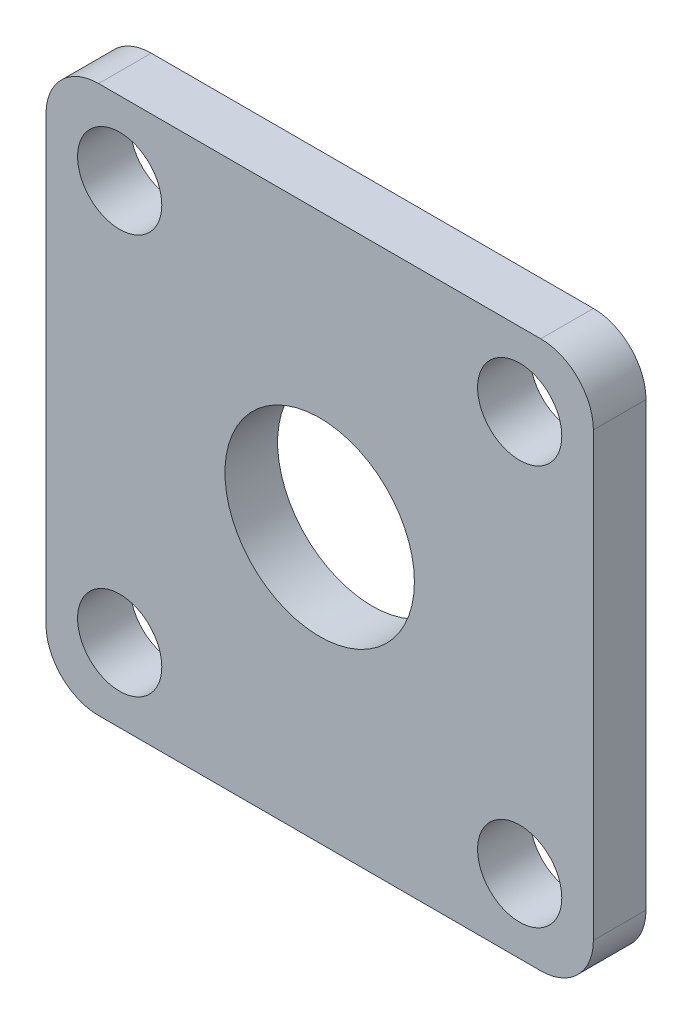
ISO-10303-21;
HEADER;
FILE_DESCRIPTION(('STEP AP214'),'2;1');
FILE_NAME('part.step','',(''),(''),'','','');
FILE_SCHEMA(('AUTOMOTIVE_DESIGN { 1 0 10303 214 1 1 1 1 }'));
ENDSEC;
DATA;
#1=APPLICATION_CONTEXT('core data for automotive mechanical design processes');
#2=APPLICATION_PROTOCOL_DEFINITION('international standard','automotive_design',2000,#1);
#3=PRODUCT_CONTEXT('',#1,'mechanical');
#4=PRODUCT('Part','Part','',(#3));
#5=PRODUCT_RELATED_PRODUCT_CATEGORY('part','',(#4));
#6=PRODUCT_DEFINITION_FORMATION('','',#4);
#7=PRODUCT_DEFINITION_CONTEXT('part definition',#1,'design');
#8=PRODUCT_DEFINITION('design','',#6,#7);
#9=PRODUCT_DEFINITION_SHAPE('','',#8);
#10=(LENGTH_UNIT() NAMED_UNIT(*) SI_UNIT(.MILLI.,.METRE.));
#11=(NAMED_UNIT(*) PLANE_ANGLE_UNIT() SI_UNIT($,.RADIAN.));
#12=(NAMED_UNIT(*) SI_UNIT($,.STERADIAN.) SOLID_ANGLE_UNIT());
#13=UNCERTAINTY_MEASURE_WITH_UNIT(LENGTH_MEASURE(1.E-05),#10,'distance_accuracy_value','');
#14=(GEOMETRIC_REPRESENTATION_CONTEXT(3) GLOBAL_UNCERTAINTY_ASSIGNED_CONTEXT((#13)) GLOBAL_UNIT_ASSIGNED_CONTEXT((#10,
#11,#12)) REPRESENTATION_CONTEXT('',''));
#15=CARTESIAN_POINT('',(0.,0.,0.));
#16=DIRECTION('',(0.,0.,1.));
#17=DIRECTION('',(1.,0.,0.));
#18=AXIS2_PLACEMENT_3D('',#15,#16,#17);
#19=CARTESIAN_POINT('',(5.,5.,5.));
#20=DIRECTION('',(0.,0.,1.));
#21=DIRECTION('',(1.,0.,0.));
#22=AXIS2_PLACEMENT_3D('',#19,#20,#21);
#23=PLANE('',#22);
#24=CARTESIAN_POINT('',(45.,7.00000000000002,5.));
#25=DIRECTION('',(0.,0.,1.));
#26=DIRECTION('',(1.,0.,0.));
#27=AXIS2_PLACEMENT_3D('',#24,#25,#26);
#28=CIRCLE('',#27,4.);
#29=CARTESIAN_POINT('',(49.,7.00000000000002,5.));
#30=VERTEX_POINT('',#29);
#31=EDGE_CURVE('E191',#30,#30,#28,.T.);
#32=ORIENTED_EDGE('',*,*,#31,.F.);
#33=EDGE_LOOP('',(#32));
#34=FACE_BOUND('',#33,.T.);
#35=CARTESIAN_POINT('',(45.,45.,5.));
#36=DIRECTION('',(0.,0.,1.));
#37=DIRECTION('',(1.,0.,0.));
#38=AXIS2_PLACEMENT_3D('',#35,#36,#37);
#39=CIRCLE('',#38,4.00000000000001);
#40=CARTESIAN_POINT('',(49.,45.,5.));
#41=VERTEX_POINT('',#40);
#42=EDGE_CURVE('E179',#41,#41,#39,.T.);
#43=ORIENTED_EDGE('',*,*,#42,.F.);
#44=EDGE_LOOP('',(#43));
#45=FACE_BOUND('',#44,.T.);
#46=CARTESIAN_POINT('',(5.,5.,5.));
#47=DIRECTION('',(0.,0.,1.));
#48=DIRECTION('',(1.,0.,0.));
#49=AXIS2_PLACEMENT_3D('',#46,#47,#48);
#50=CIRCLE('',#49,5.);
#51=CARTESIAN_POINT('',(0.,5.00000000000003,5.));
#52=VERTEX_POINT('',#51);
#53=CARTESIAN_POINT('',(5.00000000000004,0.,5.));
#54=VERTEX_POINT('',#53);
#55=EDGE_CURVE('E142',#52,#54,#50,.T.);
#56=ORIENTED_EDGE('',*,*,#55,.T.);
#57=DIRECTION('',(1.,0.,0.));
#58=VECTOR('',#57,1.);
#59=CARTESIAN_POINT('',(5.00000000000004,0.,5.));
#60=LINE('',#59,#58);
#61=CARTESIAN_POINT('',(46.9999999999999,0.,5.));
#62=VERTEX_POINT('',#61);
#63=EDGE_CURVE('E90',#54,#62,#60,.T.);
#64=ORIENTED_EDGE('',*,*,#63,.T.);
#65=CARTESIAN_POINT('',(47.,5.00000000000001,5.));
#66=DIRECTION('',(0.,0.,1.));
#67=DIRECTION('',(1.,0.,0.));
#68=AXIS2_PLACEMENT_3D('',#65,#66,#67);
#69=CIRCLE('',#68,5.);
#70=CARTESIAN_POINT('',(52.,5.00000000000005,5.));
#71=VERTEX_POINT('',#70);
#72=EDGE_CURVE('E157',#62,#71,#69,.T.);
#73=ORIENTED_EDGE('',*,*,#72,.T.);
#74=DIRECTION('',(0.,1.,0.));
#75=VECTOR('',#74,1.);
#76=CARTESIAN_POINT('',(52.,47.,5.));
#77=LINE('',#76,#75);
#78=CARTESIAN_POINT('',(52.,47.,5.));
#79=VERTEX_POINT('',#78);
#80=EDGE_CURVE('E170',#71,#79,#77,.T.);
#81=ORIENTED_EDGE('',*,*,#80,.T.);
#82=CARTESIAN_POINT('',(47.,47.,5.));
#83=DIRECTION('',(0.,0.,1.));
#84=DIRECTION('',(-1.,0.,0.));
#85=AXIS2_PLACEMENT_3D('',#82,#83,#84);
#86=CIRCLE('',#85,5.);
#87=CARTESIAN_POINT('',(46.9999999999999,52.,5.));
#88=VERTEX_POINT('',#87);
#89=EDGE_CURVE('E109',#79,#88,#86,.T.);
#90=ORIENTED_EDGE('',*,*,#89,.T.);
#91=DIRECTION('',(-1.,0.,0.));
#92=VECTOR('',#91,1.);
#93=CARTESIAN_POINT('',(5.00000000000001,52.,5.));
#94=LINE('',#93,#92);
#95=CARTESIAN_POINT('',(5.00000000000001,52.,5.));
#96=VERTEX_POINT('',#95);
#97=EDGE_CURVE('E103',#88,#96,#94,.T.);
#98=ORIENTED_EDGE('',*,*,#97,.T.);
#99=CARTESIAN_POINT('',(4.99999999999998,47.,5.));
#100=DIRECTION('',(0.,0.,1.));
#101=DIRECTION('',(1.,0.,0.));
#102=AXIS2_PLACEMENT_3D('',#99,#100,#101);
#103=CIRCLE('',#102,5.);
#104=CARTESIAN_POINT('',(0.,47.,5.));
#105=VERTEX_POINT('',#104);
#106=EDGE_CURVE('E107',#96,#105,#103,.T.);
#107=ORIENTED_EDGE('',*,*,#106,.T.);
#108=DIRECTION('',(0.,-1.,0.));
#109=VECTOR('',#108,1.);
#110=CARTESIAN_POINT('',(0.,47.,5.));
#111=LINE('',#110,#109);
#112=EDGE_CURVE('E47',#105,#52,#111,.T.);
#113=ORIENTED_EDGE('',*,*,#112,.T.);
#114=EDGE_LOOP('',(#56,#64,#73,#81,#90,#98,#107,#113));
#115=FACE_BOUND('',#114,.T.);
#116=CARTESIAN_POINT('',(6.99999999999997,45.,5.));
#117=DIRECTION('',(0.,0.,1.));
#118=DIRECTION('',(1.,0.,0.));
#119=AXIS2_PLACEMENT_3D('',#116,#117,#118);
#120=CIRCLE('',#119,4.);
#121=CARTESIAN_POINT('',(11.,45.,5.));
#122=VERTEX_POINT('',#121);
#123=EDGE_CURVE('E131',#122,#122,#120,.T.);
#124=ORIENTED_EDGE('',*,*,#123,.F.);
#125=EDGE_LOOP('',(#124));
#126=FACE_BOUND('',#125,.T.);
#127=CARTESIAN_POINT('',(7.00000000000001,6.99999999999998,5.));
#128=DIRECTION('',(0.,0.,1.));
#129=DIRECTION('',(1.,0.,0.));
#130=AXIS2_PLACEMENT_3D('',#127,#128,#129);
#131=CIRCLE('',#130,4.);
#132=CARTESIAN_POINT('',(11.,6.99999999999998,5.));
#133=VERTEX_POINT('',#132);
#134=EDGE_CURVE('E185',#133,#133,#131,.T.);
#135=ORIENTED_EDGE('',*,*,#134,.F.);
#136=EDGE_LOOP('',(#135));
#137=FACE_BOUND('',#136,.T.);
#138=CARTESIAN_POINT('',(26.,26.,5.));
#139=DIRECTION('',(0.,0.,1.));
#140=DIRECTION('',(1.,0.,0.));
#141=AXIS2_PLACEMENT_3D('',#138,#139,#140);
#142=CIRCLE('',#141,9.);
#143=CARTESIAN_POINT('',(35.,26.,5.));
#144=VERTEX_POINT('',#143);
#145=EDGE_CURVE('E197',#144,#144,#142,.T.);
#146=ORIENTED_EDGE('',*,*,#145,.F.);
#147=EDGE_LOOP('',(#146));
#148=FACE_BOUND('',#147,.T.);
#149=ADVANCED_FACE('F30',(#34,#45,#115,#126,#137,#148),#23,.T.);
#150=CARTESIAN_POINT('',(5.,5.,0.));
#151=DIRECTION('',(0.,0.,1.));
#152=DIRECTION('',(1.,0.,0.));
#153=AXIS2_PLACEMENT_3D('',#150,#151,#152);
#154=PLANE('',#153);
#155=CARTESIAN_POINT('',(45.,7.00000000000002,0.));
#156=DIRECTION('',(0.,0.,1.));
#157=DIRECTION('',(1.,0.,0.));
#158=AXIS2_PLACEMENT_3D('',#155,#156,#157);
#159=CIRCLE('',#158,4.);
#160=CARTESIAN_POINT('',(49.,7.00000000000002,0.));
#161=VERTEX_POINT('',#160);
#162=EDGE_CURVE('E194',#161,#161,#159,.T.);
#163=ORIENTED_EDGE('',*,*,#162,.T.);
#164=EDGE_LOOP('',(#163));
#165=FACE_BOUND('',#164,.T.);
#166=CARTESIAN_POINT('',(45.,45.,0.));
#167=DIRECTION('',(0.,0.,1.));
#168=DIRECTION('',(1.,0.,0.));
#169=AXIS2_PLACEMENT_3D('',#166,#167,#168);
#170=CIRCLE('',#169,4.00000000000001);
#171=CARTESIAN_POINT('',(49.,45.,0.));
#172=VERTEX_POINT('',#171);
#173=EDGE_CURVE('E182',#172,#172,#170,.T.);
#174=ORIENTED_EDGE('',*,*,#173,.T.);
#175=EDGE_LOOP('',(#174));
#176=FACE_BOUND('',#175,.T.);
#177=CARTESIAN_POINT('',(5.,5.,0.));
#178=DIRECTION('',(0.,0.,1.));
#179=DIRECTION('',(1.,0.,0.));
#180=AXIS2_PLACEMENT_3D('',#177,#178,#179);
#181=CIRCLE('',#180,5.);
#182=CARTESIAN_POINT('',(0.,5.00000000000003,0.));
#183=VERTEX_POINT('',#182);
#184=CARTESIAN_POINT('',(5.00000000000004,0.,0.));
#185=VERTEX_POINT('',#184);
#186=EDGE_CURVE('E127',#183,#185,#181,.T.);
#187=ORIENTED_EDGE('',*,*,#186,.F.);
#188=DIRECTION('',(0.,-1.,0.));
#189=VECTOR('',#188,1.);
#190=CARTESIAN_POINT('',(0.,47.,0.));
#191=LINE('',#190,#189);
#192=CARTESIAN_POINT('',(0.,47.,0.));
#193=VERTEX_POINT('',#192);
#194=EDGE_CURVE('E82',#193,#183,#191,.T.);
#195=ORIENTED_EDGE('',*,*,#194,.F.);
#196=CARTESIAN_POINT('',(4.99999999999998,47.,0.));
#197=DIRECTION('',(0.,0.,1.));
#198=DIRECTION('',(1.,0.,0.));
#199=AXIS2_PLACEMENT_3D('',#196,#197,#198);
#200=CIRCLE('',#199,5.);
#201=CARTESIAN_POINT('',(5.00000000000001,52.,0.));
#202=VERTEX_POINT('',#201);
#203=EDGE_CURVE('E76',#202,#193,#200,.T.);
#204=ORIENTED_EDGE('',*,*,#203,.F.);
#205=DIRECTION('',(-1.,0.,0.));
#206=VECTOR('',#205,1.);
#207=CARTESIAN_POINT('',(5.00000000000001,52.,0.));
#208=LINE('',#207,#206);
#209=CARTESIAN_POINT('',(46.9999999999999,52.,0.));
#210=VERTEX_POINT('',#209);
#211=EDGE_CURVE('E117',#210,#202,#208,.T.);
#212=ORIENTED_EDGE('',*,*,#211,.F.);
#213=CARTESIAN_POINT('',(47.,47.,0.));
#214=DIRECTION('',(0.,0.,1.));
#215=DIRECTION('',(-1.,0.,0.));
#216=AXIS2_PLACEMENT_3D('',#213,#214,#215);
#217=CIRCLE('',#216,5.);
#218=CARTESIAN_POINT('',(52.,47.,0.));
#219=VERTEX_POINT('',#218);
#220=EDGE_CURVE('E137',#219,#210,#217,.T.);
#221=ORIENTED_EDGE('',*,*,#220,.F.);
#222=DIRECTION('',(0.,1.,0.));
#223=VECTOR('',#222,1.);
#224=CARTESIAN_POINT('',(52.,47.,0.));
#225=LINE('',#224,#223);
#226=CARTESIAN_POINT('',(52.,5.00000000000005,0.));
#227=VERTEX_POINT('',#226);
#228=EDGE_CURVE('E135',#227,#219,#225,.T.);
#229=ORIENTED_EDGE('',*,*,#228,.F.);
#230=CARTESIAN_POINT('',(47.,5.00000000000001,0.));
#231=DIRECTION('',(0.,0.,1.));
#232=DIRECTION('',(1.,0.,0.));
#233=AXIS2_PLACEMENT_3D('',#230,#231,#232);
#234=CIRCLE('',#233,5.);
#235=CARTESIAN_POINT('',(46.9999999999999,0.,0.));
#236=VERTEX_POINT('',#235);
#237=EDGE_CURVE('E133',#236,#227,#234,.T.);
#238=ORIENTED_EDGE('',*,*,#237,.F.);
#239=DIRECTION('',(1.,0.,0.));
#240=VECTOR('',#239,1.);
#241=CARTESIAN_POINT('',(5.00000000000004,0.,0.));
#242=LINE('',#241,#240);
#243=EDGE_CURVE('E130',#185,#236,#242,.T.);
#244=ORIENTED_EDGE('',*,*,#243,.F.);
#245=EDGE_LOOP('',(#187,#195,#204,#212,#221,#229,#238,#244));
#246=FACE_BOUND('',#245,.T.);
#247=CARTESIAN_POINT('',(6.99999999999997,45.,0.));
#248=DIRECTION('',(0.,0.,1.));
#249=DIRECTION('',(1.,0.,0.));
#250=AXIS2_PLACEMENT_3D('',#247,#248,#249);
#251=CIRCLE('',#250,4.);
#252=CARTESIAN_POINT('',(11.,45.,0.));
#253=VERTEX_POINT('',#252);
#254=EDGE_CURVE('E176',#253,#253,#251,.T.);
#255=ORIENTED_EDGE('',*,*,#254,.T.);
#256=EDGE_LOOP('',(#255));
#257=FACE_BOUND('',#256,.T.);
#258=CARTESIAN_POINT('',(7.00000000000001,6.99999999999998,0.));
#259=DIRECTION('',(0.,0.,1.));
#260=DIRECTION('',(1.,0.,0.));
#261=AXIS2_PLACEMENT_3D('',#258,#259,#260);
#262=CIRCLE('',#261,4.);
#263=CARTESIAN_POINT('',(11.,6.99999999999998,0.));
#264=VERTEX_POINT('',#263);
#265=EDGE_CURVE('E188',#264,#264,#262,.T.);
#266=ORIENTED_EDGE('',*,*,#265,.T.);
#267=EDGE_LOOP('',(#266));
#268=FACE_BOUND('',#267,.T.);
#269=CARTESIAN_POINT('',(26.,26.,0.));
#270=DIRECTION('',(0.,0.,1.));
#271=DIRECTION('',(1.,0.,0.));
#272=AXIS2_PLACEMENT_3D('',#269,#270,#271);
#273=CIRCLE('',#272,9.);
#274=CARTESIAN_POINT('',(35.,26.,0.));
#275=VERTEX_POINT('',#274);
#276=EDGE_CURVE('E200',#275,#275,#273,.T.);
#277=ORIENTED_EDGE('',*,*,#276,.T.);
#278=EDGE_LOOP('',(#277));
#279=FACE_BOUND('',#278,.T.);
#280=ADVANCED_FACE('F161',(#165,#176,#246,#257,#268,#279),#154,.F.);
#281=CARTESIAN_POINT('',(5.,5.,5.));
#282=DIRECTION('',(0.,0.,-1.));
#283=DIRECTION('',(-1.,0.,0.));
#284=AXIS2_PLACEMENT_3D('',#281,#282,#283);
#285=CYLINDRICAL_SURFACE('',#284,5.);
#286=ORIENTED_EDGE('',*,*,#186,.T.);
#287=DIRECTION('',(0.,0.,-1.));
#288=VECTOR('',#287,1.);
#289=CARTESIAN_POINT('',(5.00000000000004,0.,5.));
#290=LINE('',#289,#288);
#291=EDGE_CURVE('E11',#54,#185,#290,.T.);
#292=ORIENTED_EDGE('',*,*,#291,.F.);
#293=ORIENTED_EDGE('',*,*,#55,.F.);
#294=DIRECTION('',(0.,0.,-1.));
#295=VECTOR('',#294,1.);
#296=CARTESIAN_POINT('',(0.,5.00000000000003,5.));
#297=LINE('',#296,#295);
#298=EDGE_CURVE('E123',#52,#183,#297,.T.);
#299=ORIENTED_EDGE('',*,*,#298,.T.);
#300=EDGE_LOOP('',(#286,#292,#293,#299));
#301=FACE_BOUND('',#300,.T.);
#302=ADVANCED_FACE('F32',(#301),#285,.T.);
#303=CARTESIAN_POINT('',(5.00000000000004,0.,5.));
#304=DIRECTION('',(0.,1.,0.));
#305=DIRECTION('',(-1.,0.,0.));
#306=AXIS2_PLACEMENT_3D('',#303,#304,#305);
#307=PLANE('',#306);
#308=ORIENTED_EDGE('',*,*,#243,.T.);
#309=DIRECTION('',(0.,0.,-1.));
#310=VECTOR('',#309,1.);
#311=CARTESIAN_POINT('',(46.9999999999999,0.,5.));
#312=LINE('',#311,#310);
#313=EDGE_CURVE('E39',#62,#236,#312,.T.);
#314=ORIENTED_EDGE('',*,*,#313,.F.);
#315=ORIENTED_EDGE('',*,*,#63,.F.);
#316=ORIENTED_EDGE('',*,*,#291,.T.);
#317=EDGE_LOOP('',(#308,#314,#315,#316));
#318=FACE_BOUND('',#317,.T.);
#319=ADVANCED_FACE('F235',(#318),#307,.F.);
#320=CARTESIAN_POINT('',(47.,5.00000000000001,5.));
#321=DIRECTION('',(0.,0.,-1.));
#322=DIRECTION('',(-1.,0.,0.));
#323=AXIS2_PLACEMENT_3D('',#320,#321,#322);
#324=CYLINDRICAL_SURFACE('',#323,5.);
#325=ORIENTED_EDGE('',*,*,#237,.T.);
#326=DIRECTION('',(0.,0.,-1.));
#327=VECTOR('',#326,1.);
#328=CARTESIAN_POINT('',(52.,5.00000000000005,5.));
#329=LINE('',#328,#327);
#330=EDGE_CURVE('E149',#71,#227,#329,.T.);
#331=ORIENTED_EDGE('',*,*,#330,.F.);
#332=ORIENTED_EDGE('',*,*,#72,.F.);
#333=ORIENTED_EDGE('',*,*,#313,.T.);
#334=EDGE_LOOP('',(#325,#331,#332,#333));
#335=FACE_BOUND('',#334,.T.);
#336=ADVANCED_FACE('F155',(#335),#324,.T.);
#337=CARTESIAN_POINT('',(52.,47.,5.));
#338=DIRECTION('',(-1.,0.,0.));
#339=DIRECTION('',(0.,-1.,0.));
#340=AXIS2_PLACEMENT_3D('',#337,#338,#339);
#341=PLANE('',#340);
#342=ORIENTED_EDGE('',*,*,#228,.T.);
#343=DIRECTION('',(0.,0.,-1.));
#344=VECTOR('',#343,1.);
#345=CARTESIAN_POINT('',(52.,47.,5.));
#346=LINE('',#345,#344);
#347=EDGE_CURVE('E146',#79,#219,#346,.T.);
#348=ORIENTED_EDGE('',*,*,#347,.F.);
#349=ORIENTED_EDGE('',*,*,#80,.F.);
#350=ORIENTED_EDGE('',*,*,#330,.T.);
#351=EDGE_LOOP('',(#342,#348,#349,#350));
#352=FACE_BOUND('',#351,.T.);
#353=ADVANCED_FACE('F166',(#352),#341,.F.);
#354=CARTESIAN_POINT('',(47.,47.,5.));
#355=DIRECTION('',(0.,0.,-1.));
#356=DIRECTION('',(-1.,0.,0.));
#357=AXIS2_PLACEMENT_3D('',#354,#355,#356);
#358=CYLINDRICAL_SURFACE('',#357,5.);
#359=ORIENTED_EDGE('',*,*,#220,.T.);
#360=DIRECTION('',(0.,0.,-1.));
#361=VECTOR('',#360,1.);
#362=CARTESIAN_POINT('',(46.9999999999999,52.,5.));
#363=LINE('',#362,#361);
#364=EDGE_CURVE('E118',#88,#210,#363,.T.);
#365=ORIENTED_EDGE('',*,*,#364,.F.);
#366=ORIENTED_EDGE('',*,*,#89,.F.);
#367=ORIENTED_EDGE('',*,*,#347,.T.);
#368=EDGE_LOOP('',(#359,#365,#366,#367));
#369=FACE_BOUND('',#368,.T.);
#370=ADVANCED_FACE('F169',(#369),#358,.T.);
#371=CARTESIAN_POINT('',(5.00000000000001,52.,5.));
#372=DIRECTION('',(0.,-1.,0.));
#373=DIRECTION('',(1.,0.,0.));
#374=AXIS2_PLACEMENT_3D('',#371,#372,#373);
#375=PLANE('',#374);
#376=ORIENTED_EDGE('',*,*,#211,.T.);
#377=DIRECTION('',(0.,0.,-1.));
#378=VECTOR('',#377,1.);
#379=CARTESIAN_POINT('',(5.00000000000001,52.,5.));
#380=LINE('',#379,#378);
#381=EDGE_CURVE('E114',#96,#202,#380,.T.);
#382=ORIENTED_EDGE('',*,*,#381,.F.);
#383=ORIENTED_EDGE('',*,*,#97,.F.);
#384=ORIENTED_EDGE('',*,*,#364,.T.);
#385=EDGE_LOOP('',(#376,#382,#383,#384));
#386=FACE_BOUND('',#385,.T.);
#387=ADVANCED_FACE('F115',(#386),#375,.F.);
#388=CARTESIAN_POINT('',(4.99999999999998,47.,5.));
#389=DIRECTION('',(0.,0.,-1.));
#390=DIRECTION('',(-1.,0.,0.));
#391=AXIS2_PLACEMENT_3D('',#388,#389,#390);
#392=CYLINDRICAL_SURFACE('',#391,5.);
#393=ORIENTED_EDGE('',*,*,#203,.T.);
#394=DIRECTION('',(0.,0.,-1.));
#395=VECTOR('',#394,1.);
#396=CARTESIAN_POINT('',(0.,47.,5.));
#397=LINE('',#396,#395);
#398=EDGE_CURVE('E119',#105,#193,#397,.T.);
#399=ORIENTED_EDGE('',*,*,#398,.F.);
#400=ORIENTED_EDGE('',*,*,#106,.F.);
#401=ORIENTED_EDGE('',*,*,#381,.T.);
#402=EDGE_LOOP('',(#393,#399,#400,#401));
#403=FACE_BOUND('',#402,.T.);
#404=ADVANCED_FACE('F121',(#403),#392,.T.);
#405=CARTESIAN_POINT('',(0.,47.,5.));
#406=DIRECTION('',(1.,0.,0.));
#407=DIRECTION('',(0.,1.,0.));
#408=AXIS2_PLACEMENT_3D('',#405,#406,#407);
#409=PLANE('',#408);
#410=ORIENTED_EDGE('',*,*,#194,.T.);
#411=ORIENTED_EDGE('',*,*,#298,.F.);
#412=ORIENTED_EDGE('',*,*,#112,.F.);
#413=ORIENTED_EDGE('',*,*,#398,.T.);
#414=EDGE_LOOP('',(#410,#411,#412,#413));
#415=FACE_BOUND('',#414,.T.);
#416=ADVANCED_FACE('F223',(#415),#409,.F.);
#417=CARTESIAN_POINT('',(6.99999999999997,45.,5.));
#418=DIRECTION('',(0.,0.,-1.));
#419=DIRECTION('',(-1.,0.,0.));
#420=AXIS2_PLACEMENT_3D('',#417,#418,#419);
#421=CYLINDRICAL_SURFACE('',#420,4.);
#422=ORIENTED_EDGE('',*,*,#123,.T.);
#423=EDGE_LOOP('',(#422));
#424=FACE_BOUND('',#423,.T.);
#425=ORIENTED_EDGE('',*,*,#254,.F.);
#426=EDGE_LOOP('',(#425));
#427=FACE_BOUND('',#426,.T.);
#428=ADVANCED_FACE('F220',(#424,#427),#421,.F.);
#429=CARTESIAN_POINT('',(45.,45.,5.));
#430=DIRECTION('',(0.,0.,-1.));
#431=DIRECTION('',(-1.,0.,0.));
#432=AXIS2_PLACEMENT_3D('',#429,#430,#431);
#433=CYLINDRICAL_SURFACE('',#432,4.00000000000001);
#434=ORIENTED_EDGE('',*,*,#42,.T.);
#435=EDGE_LOOP('',(#434));
#436=FACE_BOUND('',#435,.T.);
#437=ORIENTED_EDGE('',*,*,#173,.F.);
#438=EDGE_LOOP('',(#437));
#439=FACE_BOUND('',#438,.T.);
#440=ADVANCED_FACE('F299',(#436,#439),#433,.F.);
#441=CARTESIAN_POINT('',(7.00000000000001,6.99999999999998,5.));
#442=DIRECTION('',(0.,0.,-1.));
#443=DIRECTION('',(-1.,0.,0.));
#444=AXIS2_PLACEMENT_3D('',#441,#442,#443);
#445=CYLINDRICAL_SURFACE('',#444,4.);
#446=ORIENTED_EDGE('',*,*,#134,.T.);
#447=EDGE_LOOP('',(#446));
#448=FACE_BOUND('',#447,.T.);
#449=ORIENTED_EDGE('',*,*,#265,.F.);
#450=EDGE_LOOP('',(#449));
#451=FACE_BOUND('',#450,.T.);
#452=ADVANCED_FACE('F307',(#448,#451),#445,.F.);
#453=CARTESIAN_POINT('',(45.,7.00000000000002,5.));
#454=DIRECTION('',(0.,0.,-1.));
#455=DIRECTION('',(-1.,0.,0.));
#456=AXIS2_PLACEMENT_3D('',#453,#454,#455);
#457=CYLINDRICAL_SURFACE('',#456,4.);
#458=ORIENTED_EDGE('',*,*,#31,.T.);
#459=EDGE_LOOP('',(#458));
#460=FACE_BOUND('',#459,.T.);
#461=ORIENTED_EDGE('',*,*,#162,.F.);
#462=EDGE_LOOP('',(#461));
#463=FACE_BOUND('',#462,.T.);
#464=ADVANCED_FACE('F315',(#460,#463),#457,.F.);
#465=CARTESIAN_POINT('',(26.,26.,5.));
#466=DIRECTION('',(0.,0.,-1.));
#467=DIRECTION('',(-1.,0.,0.));
#468=AXIS2_PLACEMENT_3D('',#465,#466,#467);
#469=CYLINDRICAL_SURFACE('',#468,9.);
#470=ORIENTED_EDGE('',*,*,#145,.T.);
#471=EDGE_LOOP('',(#470));
#472=FACE_BOUND('',#471,.T.);
#473=ORIENTED_EDGE('',*,*,#276,.F.);
#474=EDGE_LOOP('',(#473));
#475=FACE_BOUND('',#474,.T.);
#476=ADVANCED_FACE('F206',(#472,#475),#469,.F.);
#477=CLOSED_SHELL('',(#149,#280,#302,#319,#336,#353,#370,#387,#404,#416,#428,#440,#452,#464,#476));
#478=MANIFOLD_SOLID_BREP('B2',#477);
#479=ADVANCED_BREP_SHAPE_REPRESENTATION('',(#18,#478),#14);
#480=SHAPE_DEFINITION_REPRESENTATION(#9,#479);
ENDSEC;
END-ISO-10303-21;
